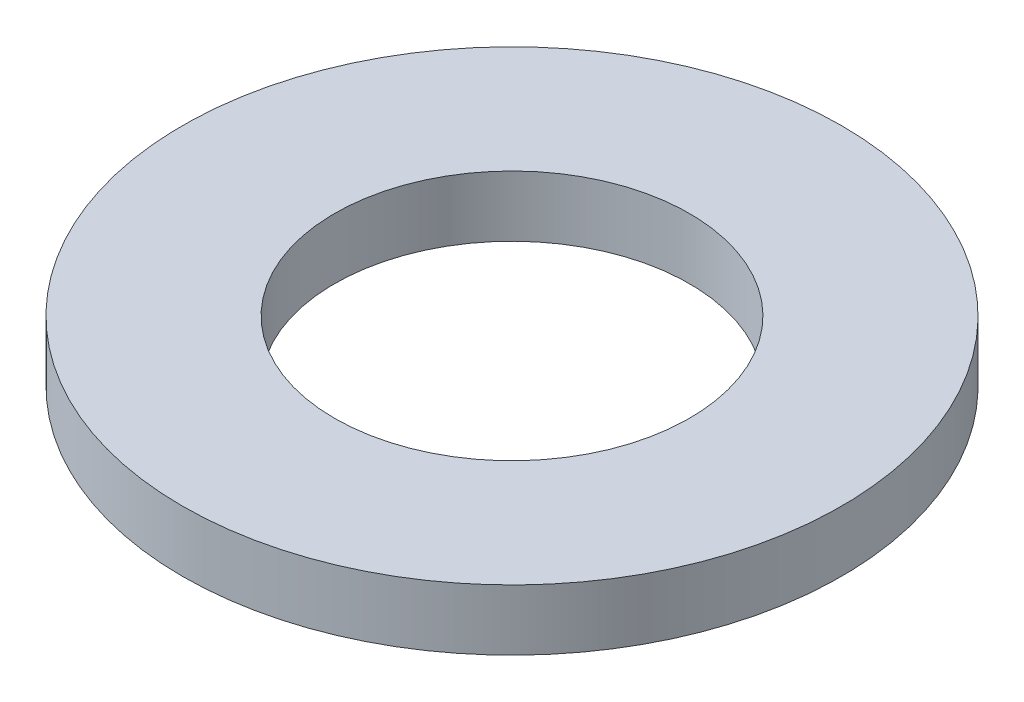
ISO-10303-21;
HEADER;
FILE_DESCRIPTION(('STEP AP214'),'2;1');
FILE_NAME('part.step','',(''),(''),'','','');
FILE_SCHEMA(('AUTOMOTIVE_DESIGN { 1 0 10303 214 1 1 1 1 }'));
ENDSEC;
DATA;
#1=APPLICATION_CONTEXT('core data for automotive mechanical design processes');
#2=APPLICATION_PROTOCOL_DEFINITION('international standard','automotive_design',2000,#1);
#3=PRODUCT_CONTEXT('',#1,'mechanical');
#4=PRODUCT('Part','Part','',(#3));
#5=PRODUCT_RELATED_PRODUCT_CATEGORY('part','',(#4));
#6=PRODUCT_DEFINITION_FORMATION('','',#4);
#7=PRODUCT_DEFINITION_CONTEXT('part definition',#1,'design');
#8=PRODUCT_DEFINITION('design','',#6,#7);
#9=PRODUCT_DEFINITION_SHAPE('','',#8);
#10=(LENGTH_UNIT() NAMED_UNIT(*) SI_UNIT(.MILLI.,.METRE.));
#11=(NAMED_UNIT(*) PLANE_ANGLE_UNIT() SI_UNIT($,.RADIAN.));
#12=(NAMED_UNIT(*) SI_UNIT($,.STERADIAN.) SOLID_ANGLE_UNIT());
#13=UNCERTAINTY_MEASURE_WITH_UNIT(LENGTH_MEASURE(1.E-05),#10,'distance_accuracy_value','');
#14=(GEOMETRIC_REPRESENTATION_CONTEXT(3) GLOBAL_UNCERTAINTY_ASSIGNED_CONTEXT((#13)) GLOBAL_UNIT_ASSIGNED_CONTEXT((#10,
#11,#12)) REPRESENTATION_CONTEXT('',''));
#15=CARTESIAN_POINT('',(0.,0.,0.));
#16=DIRECTION('',(0.,0.,1.));
#17=DIRECTION('',(1.,0.,0.));
#18=AXIS2_PLACEMENT_3D('',#15,#16,#17);
#19=CARTESIAN_POINT('',(0.,12.,0.));
#20=DIRECTION('',(0.,-1.,0.));
#21=DIRECTION('',(0.,0.,-1.));
#22=AXIS2_PLACEMENT_3D('',#19,#20,#21);
#23=CYLINDRICAL_SURFACE('',#22,65.);
#24=CARTESIAN_POINT('',(0.,12.,0.));
#25=DIRECTION('',(0.,1.,0.));
#26=DIRECTION('',(0.,0.,1.));
#27=AXIS2_PLACEMENT_3D('',#24,#25,#26);
#28=CIRCLE('',#27,65.);
#29=CARTESIAN_POINT('',(0.,12.,65.));
#30=VERTEX_POINT('',#29);
#31=EDGE_CURVE('E10',#30,#30,#28,.T.);
#32=ORIENTED_EDGE('',*,*,#31,.F.);
#33=EDGE_LOOP('',(#32));
#34=FACE_BOUND('',#33,.T.);
#35=CARTESIAN_POINT('',(0.,0.,0.));
#36=DIRECTION('',(0.,1.,0.));
#37=DIRECTION('',(0.,0.,1.));
#38=AXIS2_PLACEMENT_3D('',#35,#36,#37);
#39=CIRCLE('',#38,65.);
#40=CARTESIAN_POINT('',(0.,0.,65.));
#41=VERTEX_POINT('',#40);
#42=EDGE_CURVE('E37',#41,#41,#39,.T.);
#43=ORIENTED_EDGE('',*,*,#42,.T.);
#44=EDGE_LOOP('',(#43));
#45=FACE_BOUND('',#44,.T.);
#46=ADVANCED_FACE('F40',(#34,#45),#23,.T.);
#47=CARTESIAN_POINT('',(0.,12.,0.));
#48=DIRECTION('',(0.,1.,0.));
#49=DIRECTION('',(0.,0.,1.));
#50=AXIS2_PLACEMENT_3D('',#47,#48,#49);
#51=PLANE('',#50);
#52=CARTESIAN_POINT('',(0.,12.,0.));
#53=DIRECTION('',(0.,1.,0.));
#54=DIRECTION('',(0.,0.,1.));
#55=AXIS2_PLACEMENT_3D('',#52,#53,#54);
#56=CIRCLE('',#55,35.);
#57=CARTESIAN_POINT('',(0.,12.,35.));
#58=VERTEX_POINT('',#57);
#59=EDGE_CURVE('E50',#58,#58,#56,.T.);
#60=ORIENTED_EDGE('',*,*,#59,.F.);
#61=EDGE_LOOP('',(#60));
#62=FACE_BOUND('',#61,.T.);
#63=ORIENTED_EDGE('',*,*,#31,.T.);
#64=EDGE_LOOP('',(#63));
#65=FACE_BOUND('',#64,.T.);
#66=ADVANCED_FACE('F59',(#62,#65),#51,.T.);
#67=CARTESIAN_POINT('',(0.,0.,0.));
#68=DIRECTION('',(0.,1.,0.));
#69=DIRECTION('',(0.,0.,1.));
#70=AXIS2_PLACEMENT_3D('',#67,#68,#69);
#71=PLANE('',#70);
#72=CARTESIAN_POINT('',(0.,0.,0.));
#73=DIRECTION('',(0.,1.,0.));
#74=DIRECTION('',(0.,0.,1.));
#75=AXIS2_PLACEMENT_3D('',#72,#73,#74);
#76=CIRCLE('',#75,35.);
#77=CARTESIAN_POINT('',(0.,0.,35.));
#78=VERTEX_POINT('',#77);
#79=EDGE_CURVE('E47',#78,#78,#76,.T.);
#80=ORIENTED_EDGE('',*,*,#79,.T.);
#81=EDGE_LOOP('',(#80));
#82=FACE_BOUND('',#81,.T.);
#83=ORIENTED_EDGE('',*,*,#42,.F.);
#84=EDGE_LOOP('',(#83));
#85=FACE_BOUND('',#84,.T.);
#86=ADVANCED_FACE('F58',(#82,#85),#71,.F.);
#87=CARTESIAN_POINT('',(0.,12.,0.));
#88=DIRECTION('',(0.,-1.,0.));
#89=DIRECTION('',(0.,0.,-1.));
#90=AXIS2_PLACEMENT_3D('',#87,#88,#89);
#91=CYLINDRICAL_SURFACE('',#90,35.);
#92=ORIENTED_EDGE('',*,*,#59,.T.);
#93=EDGE_LOOP('',(#92));
#94=FACE_BOUND('',#93,.T.);
#95=ORIENTED_EDGE('',*,*,#79,.F.);
#96=EDGE_LOOP('',(#95));
#97=FACE_BOUND('',#96,.T.);
#98=ADVANCED_FACE('F54',(#94,#97),#91,.F.);
#99=CLOSED_SHELL('',(#46,#66,#86,#98));
#100=MANIFOLD_SOLID_BREP('B2',#99);
#101=ADVANCED_BREP_SHAPE_REPRESENTATION('',(#18,#100),#14);
#102=SHAPE_DEFINITION_REPRESENTATION(#9,#101);
ENDSEC;
END-ISO-10303-21;
